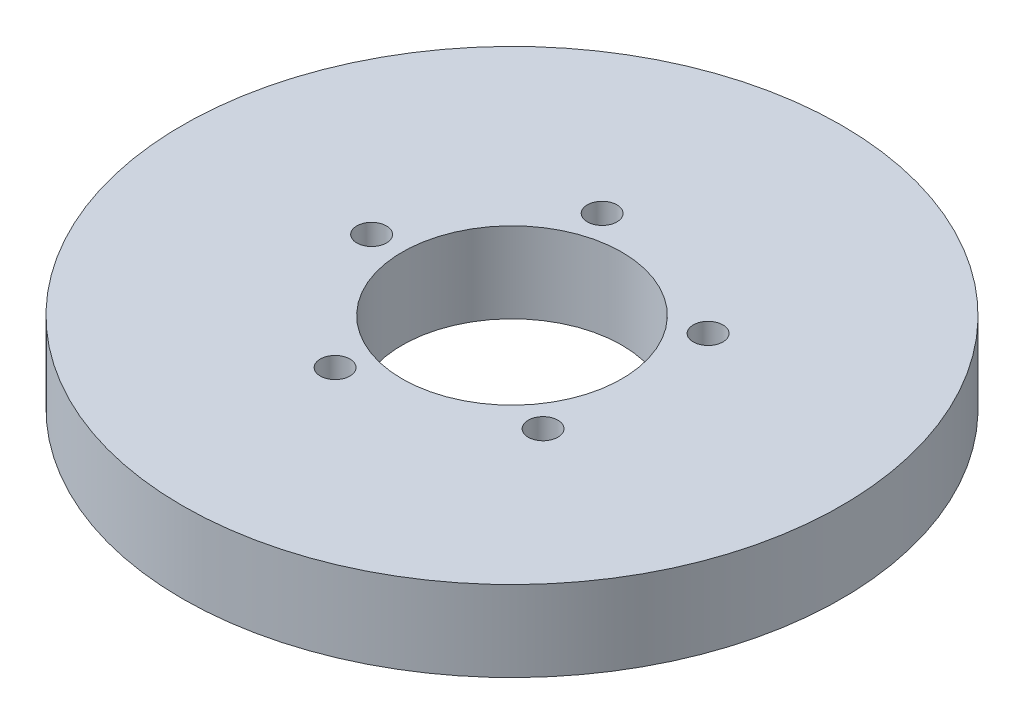
ISO-10303-21;
HEADER;
FILE_DESCRIPTION(('STEP AP214'),'2;1');
FILE_NAME('part.step','',(''),(''),'','','');
FILE_SCHEMA(('AUTOMOTIVE_DESIGN { 1 0 10303 214 1 1 1 1 }'));
ENDSEC;
DATA;
#1=APPLICATION_CONTEXT('core data for automotive mechanical design processes');
#2=APPLICATION_PROTOCOL_DEFINITION('international standard','automotive_design',2000,#1);
#3=PRODUCT_CONTEXT('',#1,'mechanical');
#4=PRODUCT('Part','Part','',(#3));
#5=PRODUCT_RELATED_PRODUCT_CATEGORY('part','',(#4));
#6=PRODUCT_DEFINITION_FORMATION('','',#4);
#7=PRODUCT_DEFINITION_CONTEXT('part definition',#1,'design');
#8=PRODUCT_DEFINITION('design','',#6,#7);
#9=PRODUCT_DEFINITION_SHAPE('','',#8);
#10=(LENGTH_UNIT() NAMED_UNIT(*) SI_UNIT(.MILLI.,.METRE.));
#11=(NAMED_UNIT(*) PLANE_ANGLE_UNIT() SI_UNIT($,.RADIAN.));
#12=(NAMED_UNIT(*) SI_UNIT($,.STERADIAN.) SOLID_ANGLE_UNIT());
#13=UNCERTAINTY_MEASURE_WITH_UNIT(LENGTH_MEASURE(1.E-05),#10,'distance_accuracy_value','');
#14=(GEOMETRIC_REPRESENTATION_CONTEXT(3) GLOBAL_UNCERTAINTY_ASSIGNED_CONTEXT((#13)) GLOBAL_UNIT_ASSIGNED_CONTEXT((#10,
#11,#12)) REPRESENTATION_CONTEXT('',''));
#15=CARTESIAN_POINT('',(0.,0.,0.));
#16=DIRECTION('',(0.,0.,1.));
#17=DIRECTION('',(1.,0.,0.));
#18=AXIS2_PLACEMENT_3D('',#15,#16,#17);
#19=CARTESIAN_POINT('',(0.,11.,0.));
#20=DIRECTION('',(0.,-1.,0.));
#21=DIRECTION('',(0.,0.,-1.));
#22=AXIS2_PLACEMENT_3D('',#19,#20,#21);
#23=CYLINDRICAL_SURFACE('',#22,45.);
#24=CARTESIAN_POINT('',(0.,11.,0.));
#25=DIRECTION('',(0.,1.,0.));
#26=DIRECTION('',(0.,0.,1.));
#27=AXIS2_PLACEMENT_3D('',#24,#25,#26);
#28=CIRCLE('',#27,45.);
#29=CARTESIAN_POINT('',(0.,11.,45.));
#30=VERTEX_POINT('',#29);
#31=EDGE_CURVE('E10',#30,#30,#28,.T.);
#32=ORIENTED_EDGE('',*,*,#31,.F.);
#33=EDGE_LOOP('',(#32));
#34=FACE_BOUND('',#33,.T.);
#35=CARTESIAN_POINT('',(0.,0.,0.));
#36=DIRECTION('',(0.,1.,0.));
#37=DIRECTION('',(0.,0.,1.));
#38=AXIS2_PLACEMENT_3D('',#35,#36,#37);
#39=CIRCLE('',#38,45.);
#40=CARTESIAN_POINT('',(0.,0.,45.));
#41=VERTEX_POINT('',#40);
#42=EDGE_CURVE('E37',#41,#41,#39,.T.);
#43=ORIENTED_EDGE('',*,*,#42,.T.);
#44=EDGE_LOOP('',(#43));
#45=FACE_BOUND('',#44,.T.);
#46=ADVANCED_FACE('F40',(#34,#45),#23,.T.);
#47=CARTESIAN_POINT('',(0.,11.,0.));
#48=DIRECTION('',(0.,1.,0.));
#49=DIRECTION('',(0.,0.,1.));
#50=AXIS2_PLACEMENT_3D('',#47,#48,#49);
#51=PLANE('',#50);
#52=CARTESIAN_POINT('',(-5.9234889176696,11.,18.230624324552));
#53=DIRECTION('',(0.,1.,0.));
#54=DIRECTION('',(0.951056516295155,0.,0.309016994374945));
#55=AXIS2_PLACEMENT_3D('',#52,#53,#54);
#56=CIRCLE('',#55,2.02380194989782);
#57=CARTESIAN_POINT('',(-5.9234889176696,11.,20.2544262744498));
#58=VERTEX_POINT('',#57);
#59=EDGE_CURVE('E78',#58,#58,#56,.T.);
#60=ORIENTED_EDGE('',*,*,#59,.F.);
#61=EDGE_LOOP('',(#60));
#62=FACE_BOUND('',#61,.T.);
#63=CARTESIAN_POINT('',(15.5078953184425,11.,11.2671454687036));
#64=DIRECTION('',(0.,1.,0.));
#65=DIRECTION('',(0.587785252292469,0.,-0.809016994374951));
#66=AXIS2_PLACEMENT_3D('',#63,#64,#65);
#67=CIRCLE('',#66,2.02380194989782);
#68=CARTESIAN_POINT('',(15.5078953184425,11.,13.2909474186014));
#69=VERTEX_POINT('',#68);
#70=EDGE_CURVE('E71',#69,#69,#67,.T.);
#71=ORIENTED_EDGE('',*,*,#70,.F.);
#72=EDGE_LOOP('',(#71));
#73=FACE_BOUND('',#72,.T.);
#74=CARTESIAN_POINT('',(15.5078953184424,11.,-11.2671454687038));
#75=DIRECTION('',(0.,1.,0.));
#76=DIRECTION('',(-0.58778525229248,0.,-0.809016994374942));
#77=AXIS2_PLACEMENT_3D('',#74,#75,#76);
#78=CIRCLE('',#77,2.02380194989782);
#79=CARTESIAN_POINT('',(15.5078953184424,11.,-9.24334351880601));
#80=VERTEX_POINT('',#79);
#81=EDGE_CURVE('E70',#80,#80,#78,.T.);
#82=ORIENTED_EDGE('',*,*,#81,.F.);
#83=EDGE_LOOP('',(#82));
#84=FACE_BOUND('',#83,.T.);
#85=CARTESIAN_POINT('',(-5.92348891766986,11.,-18.2306243245519));
#86=DIRECTION('',(0.,1.,0.));
#87=DIRECTION('',(-0.95105651629515,0.,0.309016994374958));
#88=AXIS2_PLACEMENT_3D('',#85,#86,#87);
#89=CIRCLE('',#88,2.02380194989782);
#90=CARTESIAN_POINT('',(-5.92348891766986,11.,-16.2068223746541));
#91=VERTEX_POINT('',#90);
#92=EDGE_CURVE('E61',#91,#91,#89,.T.);
#93=ORIENTED_EDGE('',*,*,#92,.F.);
#94=EDGE_LOOP('',(#93));
#95=FACE_BOUND('',#94,.T.);
#96=CARTESIAN_POINT('',(-19.1688128015456,11.,0.));
#97=DIRECTION('',(0.,1.,0.));
#98=DIRECTION('',(0.,0.,1.));
#99=AXIS2_PLACEMENT_3D('',#96,#97,#98);
#100=CIRCLE('',#99,2.02380194989782);
#101=CARTESIAN_POINT('',(-19.1688128015456,11.,2.02380194989782));
#102=VERTEX_POINT('',#101);
#103=EDGE_CURVE('E54',#102,#102,#100,.T.);
#104=ORIENTED_EDGE('',*,*,#103,.F.);
#105=EDGE_LOOP('',(#104));
#106=FACE_BOUND('',#105,.T.);
#107=CARTESIAN_POINT('',(0.,11.,0.));
#108=DIRECTION('',(0.,1.,0.));
#109=DIRECTION('',(0.,0.,1.));
#110=AXIS2_PLACEMENT_3D('',#107,#108,#109);
#111=CIRCLE('',#110,15.);
#112=CARTESIAN_POINT('',(0.,11.,15.));
#113=VERTEX_POINT('',#112);
#114=EDGE_CURVE('E50',#113,#113,#111,.T.);
#115=ORIENTED_EDGE('',*,*,#114,.F.);
#116=EDGE_LOOP('',(#115));
#117=FACE_BOUND('',#116,.T.);
#118=ORIENTED_EDGE('',*,*,#31,.T.);
#119=EDGE_LOOP('',(#118));
#120=FACE_BOUND('',#119,.T.);
#121=ADVANCED_FACE('F94',(#62,#73,#84,#95,#106,#117,#120),#51,.T.);
#122=CARTESIAN_POINT('',(0.,0.,0.));
#123=DIRECTION('',(0.,1.,0.));
#124=DIRECTION('',(0.,0.,1.));
#125=AXIS2_PLACEMENT_3D('',#122,#123,#124);
#126=PLANE('',#125);
#127=CARTESIAN_POINT('',(0.,0.,0.));
#128=DIRECTION('',(0.,1.,0.));
#129=DIRECTION('',(0.,0.,1.));
#130=AXIS2_PLACEMENT_3D('',#127,#128,#129);
#131=CIRCLE('',#130,15.);
#132=CARTESIAN_POINT('',(0.,0.,15.));
#133=VERTEX_POINT('',#132);
#134=EDGE_CURVE('E47',#133,#133,#131,.T.);
#135=ORIENTED_EDGE('',*,*,#134,.T.);
#136=EDGE_LOOP('',(#135));
#137=FACE_BOUND('',#136,.T.);
#138=ORIENTED_EDGE('',*,*,#42,.F.);
#139=EDGE_LOOP('',(#138));
#140=FACE_BOUND('',#139,.T.);
#141=ADVANCED_FACE('F100',(#137,#140),#126,.F.);
#142=CARTESIAN_POINT('',(0.,11.,0.));
#143=DIRECTION('',(0.,-1.,0.));
#144=DIRECTION('',(0.,0.,-1.));
#145=AXIS2_PLACEMENT_3D('',#142,#143,#144);
#146=CYLINDRICAL_SURFACE('',#145,15.);
#147=ORIENTED_EDGE('',*,*,#114,.T.);
#148=EDGE_LOOP('',(#147));
#149=FACE_BOUND('',#148,.T.);
#150=ORIENTED_EDGE('',*,*,#134,.F.);
#151=EDGE_LOOP('',(#150));
#152=FACE_BOUND('',#151,.T.);
#153=ADVANCED_FACE('F108',(#149,#152),#146,.F.);
#154=CARTESIAN_POINT('',(-19.1688128015456,2.25779650129062,0.));
#155=DIRECTION('',(0.,1.,0.));
#156=DIRECTION('',(0.,0.,1.));
#157=AXIS2_PLACEMENT_3D('',#154,#155,#156);
#158=CYLINDRICAL_SURFACE('',#157,2.02380194989782);
#159=CARTESIAN_POINT('',(-19.1688128015456,2.25779650129062,0.));
#160=DIRECTION('',(0.,1.,0.));
#161=DIRECTION('',(0.,0.,1.));
#162=AXIS2_PLACEMENT_3D('',#159,#160,#161);
#163=CIRCLE('',#162,2.02380194989782);
#164=CARTESIAN_POINT('',(-19.1688128015456,2.25779650129062,2.02380194989782));
#165=VERTEX_POINT('',#164);
#166=EDGE_CURVE('E55',#165,#165,#163,.T.);
#167=CARTESIAN_POINT('',(-19.1688128015456,2.25779650129062,2.02380194989782));
#168=CARTESIAN_POINT('',(-19.1688128015456,2.34886112106884,2.02380194989782));
#169=CARTESIAN_POINT('',(-19.1688128015456,2.43992574084707,2.02380194989782));
#170=CARTESIAN_POINT('',(-19.1688128015456,2.62205498040351,2.02380194989782));
#171=CARTESIAN_POINT('',(-19.1688128015456,2.71311960018173,2.02380194989782));
#172=CARTESIAN_POINT('',(-19.1688128015456,2.89524883973818,2.02380194989782));
#173=CARTESIAN_POINT('',(-19.1688128015456,2.9863134595164,2.02380194989782));
#174=CARTESIAN_POINT('',(-19.1688128015456,3.16844269907285,2.02380194989782));
#175=CARTESIAN_POINT('',(-19.1688128015456,3.25950731885107,2.02380194989782));
#176=CARTESIAN_POINT('',(-19.1688128015456,3.44163655840752,2.02380194989782));
#177=CARTESIAN_POINT('',(-19.1688128015456,3.53270117818574,2.02380194989782));
#178=CARTESIAN_POINT('',(-19.1688128015456,3.71483041774218,2.02380194989782));
#179=CARTESIAN_POINT('',(-19.1688128015456,3.80589503752041,2.02380194989782));
#180=CARTESIAN_POINT('',(-19.1688128015456,3.98802427707685,2.02380194989782));
#181=CARTESIAN_POINT('',(-19.1688128015456,4.07908889685508,2.02380194989782));
#182=CARTESIAN_POINT('',(-19.1688128015456,4.26121813641152,2.02380194989782));
#183=CARTESIAN_POINT('',(-19.1688128015456,4.35228275618974,2.02380194989782));
#184=CARTESIAN_POINT('',(-19.1688128015456,4.53441199574619,2.02380194989782));
#185=CARTESIAN_POINT('',(-19.1688128015456,4.62547661552441,2.02380194989782));
#186=CARTESIAN_POINT('',(-19.1688128015456,4.80760585508086,2.02380194989782));
#187=CARTESIAN_POINT('',(-19.1688128015456,4.89867047485908,2.02380194989782));
#188=CARTESIAN_POINT('',(-19.1688128015456,5.08079971441552,2.02380194989782));
#189=CARTESIAN_POINT('',(-19.1688128015456,5.17186433419375,2.02380194989782));
#190=CARTESIAN_POINT('',(-19.1688128015456,5.35399357375019,2.02380194989782));
#191=CARTESIAN_POINT('',(-19.1688128015456,5.44505819352842,2.02380194989782));
#192=CARTESIAN_POINT('',(-19.1688128015456,5.62718743308486,2.02380194989782));
#193=CARTESIAN_POINT('',(-19.1688128015456,5.71825205286308,2.02380194989782));
#194=CARTESIAN_POINT('',(-19.1688128015456,5.90038129241953,2.02380194989782));
#195=CARTESIAN_POINT('',(-19.1688128015456,5.99144591219775,2.02380194989782));
#196=CARTESIAN_POINT('',(-19.1688128015456,6.1735751517542,2.02380194989782));
#197=CARTESIAN_POINT('',(-19.1688128015456,6.26463977153242,2.02380194989782));
#198=CARTESIAN_POINT('',(-19.1688128015456,6.44676901108886,2.02380194989782));
#199=CARTESIAN_POINT('',(-19.1688128015456,6.53783363086709,2.02380194989782));
#200=CARTESIAN_POINT('',(-19.1688128015456,6.71996287042353,2.02380194989782));
#201=CARTESIAN_POINT('',(-19.1688128015456,6.81102749020176,2.02380194989782));
#202=CARTESIAN_POINT('',(-19.1688128015456,6.9931567297582,2.02380194989782));
#203=CARTESIAN_POINT('',(-19.1688128015456,7.08422134953642,2.02380194989782));
#204=CARTESIAN_POINT('',(-19.1688128015456,7.26635058909287,2.02380194989782));
#205=CARTESIAN_POINT('',(-19.1688128015456,7.35741520887109,2.02380194989782));
#206=CARTESIAN_POINT('',(-19.1688128015456,7.53954444842754,2.02380194989782));
#207=CARTESIAN_POINT('',(-19.1688128015456,7.63060906820576,2.02380194989782));
#208=CARTESIAN_POINT('',(-19.1688128015456,7.81273830776221,2.02380194989782));
#209=CARTESIAN_POINT('',(-19.1688128015456,7.90380292754043,2.02380194989782));
#210=CARTESIAN_POINT('',(-19.1688128015456,8.08593216709687,2.02380194989782));
#211=CARTESIAN_POINT('',(-19.1688128015456,8.1769967868751,2.02380194989782));
#212=CARTESIAN_POINT('',(-19.1688128015456,8.35912602643154,2.02380194989782));
#213=CARTESIAN_POINT('',(-19.1688128015456,8.45019064620976,2.02380194989782));
#214=CARTESIAN_POINT('',(-19.1688128015456,8.63231988576621,2.02380194989782));
#215=CARTESIAN_POINT('',(-19.1688128015456,8.72338450554443,2.02380194989782));
#216=CARTESIAN_POINT('',(-19.1688128015456,8.90551374510088,2.02380194989782));
#217=CARTESIAN_POINT('',(-19.1688128015456,8.9965783648791,2.02380194989782));
#218=CARTESIAN_POINT('',(-19.1688128015456,9.17870760443555,2.02380194989782));
#219=CARTESIAN_POINT('',(-19.1688128015456,9.26977222421377,2.02380194989782));
#220=CARTESIAN_POINT('',(-19.1688128015456,9.45190146377021,2.02380194989782));
#221=CARTESIAN_POINT('',(-19.1688128015456,9.54296608354844,2.02380194989782));
#222=CARTESIAN_POINT('',(-19.1688128015456,9.72509532310488,2.02380194989782));
#223=CARTESIAN_POINT('',(-19.1688128015456,9.8161599428831,2.02380194989782));
#224=CARTESIAN_POINT('',(-19.1688128015456,9.99828918243955,2.02380194989782));
#225=CARTESIAN_POINT('',(-19.1688128015456,10.0893538022178,2.02380194989782));
#226=CARTESIAN_POINT('',(-19.1688128015456,10.2714830417742,2.02380194989782));
#227=CARTESIAN_POINT('',(-19.1688128015456,10.3625476615524,2.02380194989782));
#228=CARTESIAN_POINT('',(-19.1688128015456,10.5446769011089,2.02380194989782));
#229=CARTESIAN_POINT('',(-19.1688128015456,10.6357415208871,2.02380194989782));
#230=CARTESIAN_POINT('',(-19.1688128015456,10.8178707604436,2.02380194989782));
#231=CARTESIAN_POINT('',(-19.1688128015456,10.9089353802218,2.02380194989782));
#232=CARTESIAN_POINT('',(-19.1688128015456,11.,2.02380194989782));
#233=B_SPLINE_CURVE_WITH_KNOTS('',3,(#167,#168,#169,#170,#171,#172,#173,#174,#175,#176,#177,
#178,#179,#180,#181,#182,#183,#184,#185,#186,#187,#188,#189,#190,#191,#192,#193,#194,#195,#196,
#197,#198,#199,#200,#201,#202,#203,#204,#205,#206,#207,#208,#209,#210,#211,#212,#213,#214,#215,
#216,#217,#218,#219,#220,#221,#222,#223,#224,#225,#226,#227,#228,#229,#230,#231,#232),
.UNSPECIFIED.,.F.,.F.,(4,2,2,2,2,2,2,2,2,2,2,2,2,2,2,2,2,2,2,2,2,2,2,2,2,2,2,2,2,2,2,2,4),(0.,
0.273193859334668,0.546387718669336,0.819581578004004,1.09277543733867,1.36596929667334,
1.63916315600801,1.91235701534268,2.18555087467734,2.45874473401201,2.73193859334668,
3.00513245268135,3.27832631201602,3.55152017135069,3.82471403068535,4.09790789002002,
4.37110174935469,4.64429560868936,4.91748946802403,5.19068332735869,5.46387718669336,
5.73707104602803,6.0102649053627,6.28345876469736,6.55665262403203,6.8298464833667,
7.10304034270137,7.37623420203604,7.64942806137071,7.92262192070537,8.19581578004004,
8.46900963937471,8.74220349870938),.UNSPECIFIED.);
#234=EDGE_CURVE('BSEAM115',#165,#102,#233,.T.);
#235=ORIENTED_EDGE('',*,*,#166,.F.);
#236=ORIENTED_EDGE('',*,*,#103,.T.);
#237=ORIENTED_EDGE('',*,*,#234,.T.);
#238=ORIENTED_EDGE('',*,*,#234,.F.);
#239=EDGE_LOOP('',(#235,#237,#236,#238));
#240=FACE_BOUND('',#239,.T.);
#241=ADVANCED_FACE('F115',(#240),#158,.F.);
#242=CARTESIAN_POINT('',(-19.1688128015456,2.25779650129062,0.));
#243=DIRECTION('',(0.,1.,0.));
#244=DIRECTION('',(0.,0.,1.));
#245=AXIS2_PLACEMENT_3D('',#242,#243,#244);
#246=PLANE('',#245);
#247=ORIENTED_EDGE('',*,*,#166,.T.);
#248=EDGE_LOOP('',(#247));
#249=FACE_BOUND('',#248,.T.);
#250=ADVANCED_FACE('F142',(#249),#246,.T.);
#251=CARTESIAN_POINT('',(-5.92348891766986,2.25779650129062,-18.2306243245519));
#252=DIRECTION('',(0.,1.,0.));
#253=DIRECTION('',(0.,0.,1.));
#254=AXIS2_PLACEMENT_3D('',#251,#252,#253);
#255=CYLINDRICAL_SURFACE('',#254,2.02380194989782);
#256=CARTESIAN_POINT('',(-5.92348891766986,2.25779650129062,-18.2306243245519));
#257=DIRECTION('',(0.,1.,0.));
#258=DIRECTION('',(-0.95105651629515,0.,0.309016994374958));
#259=AXIS2_PLACEMENT_3D('',#256,#257,#258);
#260=CIRCLE('',#259,2.02380194989782);
#261=CARTESIAN_POINT('',(-5.92348891766986,2.25779650129062,-16.2068223746541));
#262=VERTEX_POINT('',#261);
#263=EDGE_CURVE('E63',#262,#262,#260,.T.);
#264=CARTESIAN_POINT('',(-5.92348891766986,2.25779650129062,-16.2068223746541));
#265=CARTESIAN_POINT('',(-5.92348891766986,2.34886112106884,-16.2068223746541));
#266=CARTESIAN_POINT('',(-5.92348891766986,2.43992574084707,-16.2068223746541));
#267=CARTESIAN_POINT('',(-5.92348891766986,2.62205498040351,-16.2068223746541));
#268=CARTESIAN_POINT('',(-5.92348891766986,2.71311960018173,-16.2068223746541));
#269=CARTESIAN_POINT('',(-5.92348891766986,2.89524883973818,-16.2068223746541));
#270=CARTESIAN_POINT('',(-5.92348891766986,2.9863134595164,-16.2068223746541));
#271=CARTESIAN_POINT('',(-5.92348891766986,3.16844269907285,-16.2068223746541));
#272=CARTESIAN_POINT('',(-5.92348891766986,3.25950731885107,-16.2068223746541));
#273=CARTESIAN_POINT('',(-5.92348891766986,3.44163655840752,-16.2068223746541));
#274=CARTESIAN_POINT('',(-5.92348891766986,3.53270117818574,-16.2068223746541));
#275=CARTESIAN_POINT('',(-5.92348891766986,3.71483041774218,-16.2068223746541));
#276=CARTESIAN_POINT('',(-5.92348891766986,3.80589503752041,-16.2068223746541));
#277=CARTESIAN_POINT('',(-5.92348891766986,3.98802427707685,-16.2068223746541));
#278=CARTESIAN_POINT('',(-5.92348891766986,4.07908889685508,-16.2068223746541));
#279=CARTESIAN_POINT('',(-5.92348891766986,4.26121813641152,-16.2068223746541));
#280=CARTESIAN_POINT('',(-5.92348891766986,4.35228275618974,-16.2068223746541));
#281=CARTESIAN_POINT('',(-5.92348891766986,4.53441199574619,-16.2068223746541));
#282=CARTESIAN_POINT('',(-5.92348891766986,4.62547661552441,-16.2068223746541));
#283=CARTESIAN_POINT('',(-5.92348891766986,4.80760585508086,-16.2068223746541));
#284=CARTESIAN_POINT('',(-5.92348891766986,4.89867047485908,-16.2068223746541));
#285=CARTESIAN_POINT('',(-5.92348891766986,5.08079971441552,-16.2068223746541));
#286=CARTESIAN_POINT('',(-5.92348891766986,5.17186433419375,-16.2068223746541));
#287=CARTESIAN_POINT('',(-5.92348891766986,5.35399357375019,-16.2068223746541));
#288=CARTESIAN_POINT('',(-5.92348891766986,5.44505819352842,-16.2068223746541));
#289=CARTESIAN_POINT('',(-5.92348891766986,5.62718743308486,-16.2068223746541));
#290=CARTESIAN_POINT('',(-5.92348891766986,5.71825205286308,-16.2068223746541));
#291=CARTESIAN_POINT('',(-5.92348891766986,5.90038129241953,-16.2068223746541));
#292=CARTESIAN_POINT('',(-5.92348891766986,5.99144591219775,-16.2068223746541));
#293=CARTESIAN_POINT('',(-5.92348891766986,6.1735751517542,-16.2068223746541));
#294=CARTESIAN_POINT('',(-5.92348891766986,6.26463977153242,-16.2068223746541));
#295=CARTESIAN_POINT('',(-5.92348891766986,6.44676901108886,-16.2068223746541));
#296=CARTESIAN_POINT('',(-5.92348891766986,6.53783363086709,-16.2068223746541));
#297=CARTESIAN_POINT('',(-5.92348891766986,6.71996287042353,-16.2068223746541));
#298=CARTESIAN_POINT('',(-5.92348891766986,6.81102749020176,-16.2068223746541));
#299=CARTESIAN_POINT('',(-5.92348891766986,6.9931567297582,-16.2068223746541));
#300=CARTESIAN_POINT('',(-5.92348891766986,7.08422134953642,-16.2068223746541));
#301=CARTESIAN_POINT('',(-5.92348891766986,7.26635058909287,-16.2068223746541));
#302=CARTESIAN_POINT('',(-5.92348891766986,7.35741520887109,-16.2068223746541));
#303=CARTESIAN_POINT('',(-5.92348891766986,7.53954444842754,-16.2068223746541));
#304=CARTESIAN_POINT('',(-5.92348891766986,7.63060906820576,-16.2068223746541));
#305=CARTESIAN_POINT('',(-5.92348891766986,7.81273830776221,-16.2068223746541));
#306=CARTESIAN_POINT('',(-5.92348891766986,7.90380292754043,-16.2068223746541));
#307=CARTESIAN_POINT('',(-5.92348891766986,8.08593216709687,-16.2068223746541));
#308=CARTESIAN_POINT('',(-5.92348891766986,8.1769967868751,-16.2068223746541));
#309=CARTESIAN_POINT('',(-5.92348891766986,8.35912602643154,-16.2068223746541));
#310=CARTESIAN_POINT('',(-5.92348891766986,8.45019064620976,-16.2068223746541));
#311=CARTESIAN_POINT('',(-5.92348891766986,8.63231988576621,-16.2068223746541));
#312=CARTESIAN_POINT('',(-5.92348891766986,8.72338450554443,-16.2068223746541));
#313=CARTESIAN_POINT('',(-5.92348891766986,8.90551374510088,-16.2068223746541));
#314=CARTESIAN_POINT('',(-5.92348891766986,8.9965783648791,-16.2068223746541));
#315=CARTESIAN_POINT('',(-5.92348891766986,9.17870760443555,-16.2068223746541));
#316=CARTESIAN_POINT('',(-5.92348891766986,9.26977222421377,-16.2068223746541));
#317=CARTESIAN_POINT('',(-5.92348891766986,9.45190146377021,-16.2068223746541));
#318=CARTESIAN_POINT('',(-5.92348891766986,9.54296608354844,-16.2068223746541));
#319=CARTESIAN_POINT('',(-5.92348891766986,9.72509532310488,-16.2068223746541));
#320=CARTESIAN_POINT('',(-5.92348891766986,9.8161599428831,-16.2068223746541));
#321=CARTESIAN_POINT('',(-5.92348891766986,9.99828918243955,-16.2068223746541));
#322=CARTESIAN_POINT('',(-5.92348891766986,10.0893538022178,-16.2068223746541));
#323=CARTESIAN_POINT('',(-5.92348891766986,10.2714830417742,-16.2068223746541));
#324=CARTESIAN_POINT('',(-5.92348891766986,10.3625476615524,-16.2068223746541));
#325=CARTESIAN_POINT('',(-5.92348891766986,10.5446769011089,-16.2068223746541));
#326=CARTESIAN_POINT('',(-5.92348891766986,10.6357415208871,-16.2068223746541));
#327=CARTESIAN_POINT('',(-5.92348891766986,10.8178707604436,-16.2068223746541));
#328=CARTESIAN_POINT('',(-5.92348891766986,10.9089353802218,-16.2068223746541));
#329=CARTESIAN_POINT('',(-5.92348891766986,11.,-16.2068223746541));
#330=B_SPLINE_CURVE_WITH_KNOTS('',3,(#264,#265,#266,#267,#268,#269,#270,#271,#272,#273,#274,
#275,#276,#277,#278,#279,#280,#281,#282,#283,#284,#285,#286,#287,#288,#289,#290,#291,#292,#293,
#294,#295,#296,#297,#298,#299,#300,#301,#302,#303,#304,#305,#306,#307,#308,#309,#310,#311,#312,
#313,#314,#315,#316,#317,#318,#319,#320,#321,#322,#323,#324,#325,#326,#327,#328,#329),
.UNSPECIFIED.,.F.,.F.,(4,2,2,2,2,2,2,2,2,2,2,2,2,2,2,2,2,2,2,2,2,2,2,2,2,2,2,2,2,2,2,2,4),(0.,
0.273193859334668,0.546387718669336,0.819581578004004,1.09277543733867,1.36596929667334,
1.63916315600801,1.91235701534268,2.18555087467734,2.45874473401201,2.73193859334668,
3.00513245268135,3.27832631201602,3.55152017135069,3.82471403068535,4.09790789002002,
4.37110174935469,4.64429560868936,4.91748946802403,5.19068332735869,5.46387718669336,
5.73707104602803,6.0102649053627,6.28345876469736,6.55665262403203,6.8298464833667,
7.10304034270137,7.37623420203604,7.64942806137071,7.92262192070537,8.19581578004004,
8.46900963937471,8.74220349870938),.UNSPECIFIED.);
#331=EDGE_CURVE('BSEAM147',#262,#91,#330,.T.);
#332=ORIENTED_EDGE('',*,*,#263,.F.);
#333=ORIENTED_EDGE('',*,*,#92,.T.);
#334=ORIENTED_EDGE('',*,*,#331,.T.);
#335=ORIENTED_EDGE('',*,*,#331,.F.);
#336=EDGE_LOOP('',(#332,#334,#333,#335));
#337=FACE_BOUND('',#336,.T.);
#338=ADVANCED_FACE('F147',(#337),#255,.F.);
#339=CARTESIAN_POINT('',(-5.92348891766986,2.25779650129062,-18.2306243245519));
#340=DIRECTION('',(0.,1.,0.));
#341=DIRECTION('',(-0.95105651629515,0.,0.309016994374958));
#342=AXIS2_PLACEMENT_3D('',#339,#340,#341);
#343=PLANE('',#342);
#344=ORIENTED_EDGE('',*,*,#263,.T.);
#345=EDGE_LOOP('',(#344));
#346=FACE_BOUND('',#345,.T.);
#347=ADVANCED_FACE('F163',(#346),#343,.T.);
#348=CARTESIAN_POINT('',(15.5078953184424,2.25779650129062,-11.2671454687038));
#349=DIRECTION('',(0.,1.,0.));
#350=DIRECTION('',(0.,0.,1.));
#351=AXIS2_PLACEMENT_3D('',#348,#349,#350);
#352=CYLINDRICAL_SURFACE('',#351,2.02380194989782);
#353=CARTESIAN_POINT('',(15.5078953184424,2.25779650129062,-11.2671454687038));
#354=DIRECTION('',(0.,1.,0.));
#355=DIRECTION('',(-0.58778525229248,0.,-0.809016994374942));
#356=AXIS2_PLACEMENT_3D('',#353,#354,#355);
#357=CIRCLE('',#356,2.02380194989782);
#358=CARTESIAN_POINT('',(15.5078953184424,2.25779650129062,-9.24334351880601));
#359=VERTEX_POINT('',#358);
#360=EDGE_CURVE('E69',#359,#359,#357,.T.);
#361=CARTESIAN_POINT('',(15.5078953184424,2.25779650129062,-9.24334351880601));
#362=CARTESIAN_POINT('',(15.5078953184424,2.34886112106884,-9.24334351880601));
#363=CARTESIAN_POINT('',(15.5078953184424,2.43992574084707,-9.24334351880601));
#364=CARTESIAN_POINT('',(15.5078953184424,2.62205498040351,-9.24334351880601));
#365=CARTESIAN_POINT('',(15.5078953184424,2.71311960018173,-9.24334351880601));
#366=CARTESIAN_POINT('',(15.5078953184424,2.89524883973818,-9.24334351880601));
#367=CARTESIAN_POINT('',(15.5078953184424,2.9863134595164,-9.24334351880601));
#368=CARTESIAN_POINT('',(15.5078953184424,3.16844269907285,-9.24334351880601));
#369=CARTESIAN_POINT('',(15.5078953184424,3.25950731885107,-9.24334351880601));
#370=CARTESIAN_POINT('',(15.5078953184424,3.44163655840752,-9.24334351880601));
#371=CARTESIAN_POINT('',(15.5078953184424,3.53270117818574,-9.24334351880601));
#372=CARTESIAN_POINT('',(15.5078953184424,3.71483041774218,-9.24334351880601));
#373=CARTESIAN_POINT('',(15.5078953184424,3.80589503752041,-9.24334351880601));
#374=CARTESIAN_POINT('',(15.5078953184424,3.98802427707685,-9.24334351880601));
#375=CARTESIAN_POINT('',(15.5078953184424,4.07908889685508,-9.24334351880601));
#376=CARTESIAN_POINT('',(15.5078953184424,4.26121813641152,-9.24334351880601));
#377=CARTESIAN_POINT('',(15.5078953184424,4.35228275618974,-9.24334351880601));
#378=CARTESIAN_POINT('',(15.5078953184424,4.53441199574619,-9.24334351880601));
#379=CARTESIAN_POINT('',(15.5078953184424,4.62547661552441,-9.24334351880601));
#380=CARTESIAN_POINT('',(15.5078953184424,4.80760585508086,-9.24334351880601));
#381=CARTESIAN_POINT('',(15.5078953184424,4.89867047485908,-9.24334351880601));
#382=CARTESIAN_POINT('',(15.5078953184424,5.08079971441552,-9.24334351880601));
#383=CARTESIAN_POINT('',(15.5078953184424,5.17186433419375,-9.24334351880601));
#384=CARTESIAN_POINT('',(15.5078953184424,5.35399357375019,-9.24334351880601));
#385=CARTESIAN_POINT('',(15.5078953184424,5.44505819352842,-9.24334351880601));
#386=CARTESIAN_POINT('',(15.5078953184424,5.62718743308486,-9.24334351880601));
#387=CARTESIAN_POINT('',(15.5078953184424,5.71825205286308,-9.24334351880601));
#388=CARTESIAN_POINT('',(15.5078953184424,5.90038129241953,-9.24334351880601));
#389=CARTESIAN_POINT('',(15.5078953184424,5.99144591219775,-9.24334351880601));
#390=CARTESIAN_POINT('',(15.5078953184424,6.1735751517542,-9.24334351880601));
#391=CARTESIAN_POINT('',(15.5078953184424,6.26463977153242,-9.24334351880601));
#392=CARTESIAN_POINT('',(15.5078953184424,6.44676901108886,-9.24334351880601));
#393=CARTESIAN_POINT('',(15.5078953184424,6.53783363086709,-9.24334351880601));
#394=CARTESIAN_POINT('',(15.5078953184424,6.71996287042353,-9.24334351880601));
#395=CARTESIAN_POINT('',(15.5078953184424,6.81102749020176,-9.24334351880601));
#396=CARTESIAN_POINT('',(15.5078953184424,6.9931567297582,-9.24334351880601));
#397=CARTESIAN_POINT('',(15.5078953184424,7.08422134953642,-9.24334351880601));
#398=CARTESIAN_POINT('',(15.5078953184424,7.26635058909287,-9.24334351880601));
#399=CARTESIAN_POINT('',(15.5078953184424,7.35741520887109,-9.24334351880601));
#400=CARTESIAN_POINT('',(15.5078953184424,7.53954444842754,-9.24334351880601));
#401=CARTESIAN_POINT('',(15.5078953184424,7.63060906820576,-9.24334351880601));
#402=CARTESIAN_POINT('',(15.5078953184424,7.81273830776221,-9.24334351880601));
#403=CARTESIAN_POINT('',(15.5078953184424,7.90380292754043,-9.24334351880601));
#404=CARTESIAN_POINT('',(15.5078953184424,8.08593216709687,-9.24334351880601));
#405=CARTESIAN_POINT('',(15.5078953184424,8.1769967868751,-9.24334351880601));
#406=CARTESIAN_POINT('',(15.5078953184424,8.35912602643154,-9.24334351880601));
#407=CARTESIAN_POINT('',(15.5078953184424,8.45019064620976,-9.24334351880601));
#408=CARTESIAN_POINT('',(15.5078953184424,8.63231988576621,-9.24334351880601));
#409=CARTESIAN_POINT('',(15.5078953184424,8.72338450554443,-9.24334351880601));
#410=CARTESIAN_POINT('',(15.5078953184424,8.90551374510088,-9.24334351880601));
#411=CARTESIAN_POINT('',(15.5078953184424,8.9965783648791,-9.24334351880601));
#412=CARTESIAN_POINT('',(15.5078953184424,9.17870760443555,-9.24334351880601));
#413=CARTESIAN_POINT('',(15.5078953184424,9.26977222421377,-9.24334351880601));
#414=CARTESIAN_POINT('',(15.5078953184424,9.45190146377021,-9.24334351880601));
#415=CARTESIAN_POINT('',(15.5078953184424,9.54296608354844,-9.24334351880601));
#416=CARTESIAN_POINT('',(15.5078953184424,9.72509532310488,-9.24334351880601));
#417=CARTESIAN_POINT('',(15.5078953184424,9.8161599428831,-9.24334351880601));
#418=CARTESIAN_POINT('',(15.5078953184424,9.99828918243955,-9.24334351880601));
#419=CARTESIAN_POINT('',(15.5078953184424,10.0893538022178,-9.24334351880601));
#420=CARTESIAN_POINT('',(15.5078953184424,10.2714830417742,-9.24334351880601));
#421=CARTESIAN_POINT('',(15.5078953184424,10.3625476615524,-9.24334351880601));
#422=CARTESIAN_POINT('',(15.5078953184424,10.5446769011089,-9.24334351880601));
#423=CARTESIAN_POINT('',(15.5078953184424,10.6357415208871,-9.24334351880601));
#424=CARTESIAN_POINT('',(15.5078953184424,10.8178707604436,-9.24334351880601));
#425=CARTESIAN_POINT('',(15.5078953184424,10.9089353802218,-9.24334351880601));
#426=CARTESIAN_POINT('',(15.5078953184424,11.,-9.24334351880601));
#427=B_SPLINE_CURVE_WITH_KNOTS('',3,(#361,#362,#363,#364,#365,#366,#367,#368,#369,#370,#371,
#372,#373,#374,#375,#376,#377,#378,#379,#380,#381,#382,#383,#384,#385,#386,#387,#388,#389,#390,
#391,#392,#393,#394,#395,#396,#397,#398,#399,#400,#401,#402,#403,#404,#405,#406,#407,#408,#409,
#410,#411,#412,#413,#414,#415,#416,#417,#418,#419,#420,#421,#422,#423,#424,#425,#426),
.UNSPECIFIED.,.F.,.F.,(4,2,2,2,2,2,2,2,2,2,2,2,2,2,2,2,2,2,2,2,2,2,2,2,2,2,2,2,2,2,2,2,4),(0.,
0.273193859334668,0.546387718669336,0.819581578004004,1.09277543733867,1.36596929667334,
1.63916315600801,1.91235701534268,2.18555087467734,2.45874473401201,2.73193859334668,
3.00513245268135,3.27832631201602,3.55152017135069,3.82471403068535,4.09790789002002,
4.37110174935469,4.64429560868936,4.91748946802403,5.19068332735869,5.46387718669336,
5.73707104602803,6.0102649053627,6.28345876469736,6.55665262403203,6.8298464833667,
7.10304034270137,7.37623420203604,7.64942806137071,7.92262192070537,8.19581578004004,
8.46900963937471,8.74220349870938),.UNSPECIFIED.);
#428=EDGE_CURVE('BSEAM172',#359,#80,#427,.T.);
#429=ORIENTED_EDGE('',*,*,#360,.F.);
#430=ORIENTED_EDGE('',*,*,#81,.T.);
#431=ORIENTED_EDGE('',*,*,#428,.T.);
#432=ORIENTED_EDGE('',*,*,#428,.F.);
#433=EDGE_LOOP('',(#429,#431,#430,#432));
#434=FACE_BOUND('',#433,.T.);
#435=ADVANCED_FACE('F172',(#434),#352,.F.);
#436=CARTESIAN_POINT('',(15.5078953184424,2.25779650129062,-11.2671454687038));
#437=DIRECTION('',(0.,1.,0.));
#438=DIRECTION('',(-0.58778525229248,0.,-0.809016994374942));
#439=AXIS2_PLACEMENT_3D('',#436,#437,#438);
#440=PLANE('',#439);
#441=ORIENTED_EDGE('',*,*,#360,.T.);
#442=EDGE_LOOP('',(#441));
#443=FACE_BOUND('',#442,.T.);
#444=ADVANCED_FACE('F185',(#443),#440,.T.);
#445=CARTESIAN_POINT('',(15.5078953184425,2.25779650129062,11.2671454687036));
#446=DIRECTION('',(0.,1.,0.));
#447=DIRECTION('',(0.,0.,1.));
#448=AXIS2_PLACEMENT_3D('',#445,#446,#447);
#449=CYLINDRICAL_SURFACE('',#448,2.02380194989782);
#450=CARTESIAN_POINT('',(15.5078953184425,2.25779650129062,11.2671454687036));
#451=DIRECTION('',(0.,1.,0.));
#452=DIRECTION('',(0.587785252292469,0.,-0.809016994374951));
#453=AXIS2_PLACEMENT_3D('',#450,#451,#452);
#454=CIRCLE('',#453,2.02380194989782);
#455=CARTESIAN_POINT('',(15.5078953184425,2.25779650129062,13.2909474186014));
#456=VERTEX_POINT('',#455);
#457=EDGE_CURVE('E76',#456,#456,#454,.T.);
#458=CARTESIAN_POINT('',(15.5078953184425,2.25779650129062,13.2909474186014));
#459=CARTESIAN_POINT('',(15.5078953184425,2.34886112106884,13.2909474186014));
#460=CARTESIAN_POINT('',(15.5078953184425,2.43992574084707,13.2909474186014));
#461=CARTESIAN_POINT('',(15.5078953184425,2.62205498040351,13.2909474186014));
#462=CARTESIAN_POINT('',(15.5078953184425,2.71311960018173,13.2909474186014));
#463=CARTESIAN_POINT('',(15.5078953184425,2.89524883973818,13.2909474186014));
#464=CARTESIAN_POINT('',(15.5078953184425,2.9863134595164,13.2909474186014));
#465=CARTESIAN_POINT('',(15.5078953184425,3.16844269907285,13.2909474186014));
#466=CARTESIAN_POINT('',(15.5078953184425,3.25950731885107,13.2909474186014));
#467=CARTESIAN_POINT('',(15.5078953184425,3.44163655840752,13.2909474186014));
#468=CARTESIAN_POINT('',(15.5078953184425,3.53270117818574,13.2909474186014));
#469=CARTESIAN_POINT('',(15.5078953184425,3.71483041774218,13.2909474186014));
#470=CARTESIAN_POINT('',(15.5078953184425,3.80589503752041,13.2909474186014));
#471=CARTESIAN_POINT('',(15.5078953184425,3.98802427707685,13.2909474186014));
#472=CARTESIAN_POINT('',(15.5078953184425,4.07908889685508,13.2909474186014));
#473=CARTESIAN_POINT('',(15.5078953184425,4.26121813641152,13.2909474186014));
#474=CARTESIAN_POINT('',(15.5078953184425,4.35228275618974,13.2909474186014));
#475=CARTESIAN_POINT('',(15.5078953184425,4.53441199574619,13.2909474186014));
#476=CARTESIAN_POINT('',(15.5078953184425,4.62547661552441,13.2909474186014));
#477=CARTESIAN_POINT('',(15.5078953184425,4.80760585508086,13.2909474186014));
#478=CARTESIAN_POINT('',(15.5078953184425,4.89867047485908,13.2909474186014));
#479=CARTESIAN_POINT('',(15.5078953184425,5.08079971441552,13.2909474186014));
#480=CARTESIAN_POINT('',(15.5078953184425,5.17186433419375,13.2909474186014));
#481=CARTESIAN_POINT('',(15.5078953184425,5.35399357375019,13.2909474186014));
#482=CARTESIAN_POINT('',(15.5078953184425,5.44505819352842,13.2909474186014));
#483=CARTESIAN_POINT('',(15.5078953184425,5.62718743308486,13.2909474186014));
#484=CARTESIAN_POINT('',(15.5078953184425,5.71825205286308,13.2909474186014));
#485=CARTESIAN_POINT('',(15.5078953184425,5.90038129241953,13.2909474186014));
#486=CARTESIAN_POINT('',(15.5078953184425,5.99144591219775,13.2909474186014));
#487=CARTESIAN_POINT('',(15.5078953184425,6.1735751517542,13.2909474186014));
#488=CARTESIAN_POINT('',(15.5078953184425,6.26463977153242,13.2909474186014));
#489=CARTESIAN_POINT('',(15.5078953184425,6.44676901108886,13.2909474186014));
#490=CARTESIAN_POINT('',(15.5078953184425,6.53783363086709,13.2909474186014));
#491=CARTESIAN_POINT('',(15.5078953184425,6.71996287042353,13.2909474186014));
#492=CARTESIAN_POINT('',(15.5078953184425,6.81102749020176,13.2909474186014));
#493=CARTESIAN_POINT('',(15.5078953184425,6.9931567297582,13.2909474186014));
#494=CARTESIAN_POINT('',(15.5078953184425,7.08422134953642,13.2909474186014));
#495=CARTESIAN_POINT('',(15.5078953184425,7.26635058909287,13.2909474186014));
#496=CARTESIAN_POINT('',(15.5078953184425,7.35741520887109,13.2909474186014));
#497=CARTESIAN_POINT('',(15.5078953184425,7.53954444842754,13.2909474186014));
#498=CARTESIAN_POINT('',(15.5078953184425,7.63060906820576,13.2909474186014));
#499=CARTESIAN_POINT('',(15.5078953184425,7.81273830776221,13.2909474186014));
#500=CARTESIAN_POINT('',(15.5078953184425,7.90380292754043,13.2909474186014));
#501=CARTESIAN_POINT('',(15.5078953184425,8.08593216709687,13.2909474186014));
#502=CARTESIAN_POINT('',(15.5078953184425,8.1769967868751,13.2909474186014));
#503=CARTESIAN_POINT('',(15.5078953184425,8.35912602643154,13.2909474186014));
#504=CARTESIAN_POINT('',(15.5078953184425,8.45019064620976,13.2909474186014));
#505=CARTESIAN_POINT('',(15.5078953184425,8.63231988576621,13.2909474186014));
#506=CARTESIAN_POINT('',(15.5078953184425,8.72338450554443,13.2909474186014));
#507=CARTESIAN_POINT('',(15.5078953184425,8.90551374510088,13.2909474186014));
#508=CARTESIAN_POINT('',(15.5078953184425,8.9965783648791,13.2909474186014));
#509=CARTESIAN_POINT('',(15.5078953184425,9.17870760443555,13.2909474186014));
#510=CARTESIAN_POINT('',(15.5078953184425,9.26977222421377,13.2909474186014));
#511=CARTESIAN_POINT('',(15.5078953184425,9.45190146377021,13.2909474186014));
#512=CARTESIAN_POINT('',(15.5078953184425,9.54296608354844,13.2909474186014));
#513=CARTESIAN_POINT('',(15.5078953184425,9.72509532310488,13.2909474186014));
#514=CARTESIAN_POINT('',(15.5078953184425,9.8161599428831,13.2909474186014));
#515=CARTESIAN_POINT('',(15.5078953184425,9.99828918243955,13.2909474186014));
#516=CARTESIAN_POINT('',(15.5078953184425,10.0893538022178,13.2909474186014));
#517=CARTESIAN_POINT('',(15.5078953184425,10.2714830417742,13.2909474186014));
#518=CARTESIAN_POINT('',(15.5078953184425,10.3625476615524,13.2909474186014));
#519=CARTESIAN_POINT('',(15.5078953184425,10.5446769011089,13.2909474186014));
#520=CARTESIAN_POINT('',(15.5078953184425,10.6357415208871,13.2909474186014));
#521=CARTESIAN_POINT('',(15.5078953184425,10.8178707604436,13.2909474186014));
#522=CARTESIAN_POINT('',(15.5078953184425,10.9089353802218,13.2909474186014));
#523=CARTESIAN_POINT('',(15.5078953184425,11.,13.2909474186014));
#524=B_SPLINE_CURVE_WITH_KNOTS('',3,(#458,#459,#460,#461,#462,#463,#464,#465,#466,#467,#468,
#469,#470,#471,#472,#473,#474,#475,#476,#477,#478,#479,#480,#481,#482,#483,#484,#485,#486,#487,
#488,#489,#490,#491,#492,#493,#494,#495,#496,#497,#498,#499,#500,#501,#502,#503,#504,#505,#506,
#507,#508,#509,#510,#511,#512,#513,#514,#515,#516,#517,#518,#519,#520,#521,#522,#523),
.UNSPECIFIED.,.F.,.F.,(4,2,2,2,2,2,2,2,2,2,2,2,2,2,2,2,2,2,2,2,2,2,2,2,2,2,2,2,2,2,2,2,4),(0.,
0.273193859334668,0.546387718669336,0.819581578004004,1.09277543733867,1.36596929667334,
1.63916315600801,1.91235701534268,2.18555087467734,2.45874473401201,2.73193859334668,
3.00513245268135,3.27832631201602,3.55152017135069,3.82471403068535,4.09790789002002,
4.37110174935469,4.64429560868936,4.91748946802403,5.19068332735869,5.46387718669336,
5.73707104602803,6.0102649053627,6.28345876469736,6.55665262403203,6.8298464833667,
7.10304034270137,7.37623420203604,7.64942806137071,7.92262192070537,8.19581578004004,
8.46900963937471,8.74220349870938),.UNSPECIFIED.);
#525=EDGE_CURVE('BSEAM191',#456,#69,#524,.T.);
#526=ORIENTED_EDGE('',*,*,#457,.F.);
#527=ORIENTED_EDGE('',*,*,#70,.T.);
#528=ORIENTED_EDGE('',*,*,#525,.T.);
#529=ORIENTED_EDGE('',*,*,#525,.F.);
#530=EDGE_LOOP('',(#526,#528,#527,#529));
#531=FACE_BOUND('',#530,.T.);
#532=ADVANCED_FACE('F191',(#531),#449,.F.);
#533=CARTESIAN_POINT('',(15.5078953184425,2.25779650129062,11.2671454687036));
#534=DIRECTION('',(0.,1.,0.));
#535=DIRECTION('',(0.587785252292469,0.,-0.809016994374951));
#536=AXIS2_PLACEMENT_3D('',#533,#534,#535);
#537=PLANE('',#536);
#538=ORIENTED_EDGE('',*,*,#457,.T.);
#539=EDGE_LOOP('',(#538));
#540=FACE_BOUND('',#539,.T.);
#541=ADVANCED_FACE('F89',(#540),#537,.T.);
#542=CARTESIAN_POINT('',(-5.9234889176696,2.25779650129062,18.230624324552));
#543=DIRECTION('',(0.,1.,0.));
#544=DIRECTION('',(0.,0.,1.));
#545=AXIS2_PLACEMENT_3D('',#542,#543,#544);
#546=CYLINDRICAL_SURFACE('',#545,2.02380194989782);
#547=CARTESIAN_POINT('',(-5.9234889176696,2.25779650129062,18.230624324552));
#548=DIRECTION('',(0.,1.,0.));
#549=DIRECTION('',(0.951056516295155,0.,0.309016994374945));
#550=AXIS2_PLACEMENT_3D('',#547,#548,#549);
#551=CIRCLE('',#550,2.02380194989782);
#552=CARTESIAN_POINT('',(-5.9234889176696,2.25779650129062,20.2544262744498));
#553=VERTEX_POINT('',#552);
#554=EDGE_CURVE('E59',#553,#553,#551,.T.);
#555=CARTESIAN_POINT('',(-5.9234889176696,2.25779650129062,20.2544262744498));
#556=CARTESIAN_POINT('',(-5.9234889176696,2.34886112106884,20.2544262744498));
#557=CARTESIAN_POINT('',(-5.9234889176696,2.43992574084707,20.2544262744498));
#558=CARTESIAN_POINT('',(-5.9234889176696,2.62205498040351,20.2544262744498));
#559=CARTESIAN_POINT('',(-5.9234889176696,2.71311960018173,20.2544262744498));
#560=CARTESIAN_POINT('',(-5.9234889176696,2.89524883973818,20.2544262744498));
#561=CARTESIAN_POINT('',(-5.9234889176696,2.9863134595164,20.2544262744498));
#562=CARTESIAN_POINT('',(-5.9234889176696,3.16844269907285,20.2544262744498));
#563=CARTESIAN_POINT('',(-5.9234889176696,3.25950731885107,20.2544262744498));
#564=CARTESIAN_POINT('',(-5.9234889176696,3.44163655840752,20.2544262744498));
#565=CARTESIAN_POINT('',(-5.9234889176696,3.53270117818574,20.2544262744498));
#566=CARTESIAN_POINT('',(-5.9234889176696,3.71483041774218,20.2544262744498));
#567=CARTESIAN_POINT('',(-5.9234889176696,3.80589503752041,20.2544262744498));
#568=CARTESIAN_POINT('',(-5.9234889176696,3.98802427707685,20.2544262744498));
#569=CARTESIAN_POINT('',(-5.9234889176696,4.07908889685508,20.2544262744498));
#570=CARTESIAN_POINT('',(-5.9234889176696,4.26121813641152,20.2544262744498));
#571=CARTESIAN_POINT('',(-5.9234889176696,4.35228275618974,20.2544262744498));
#572=CARTESIAN_POINT('',(-5.9234889176696,4.53441199574619,20.2544262744498));
#573=CARTESIAN_POINT('',(-5.9234889176696,4.62547661552441,20.2544262744498));
#574=CARTESIAN_POINT('',(-5.9234889176696,4.80760585508086,20.2544262744498));
#575=CARTESIAN_POINT('',(-5.9234889176696,4.89867047485908,20.2544262744498));
#576=CARTESIAN_POINT('',(-5.9234889176696,5.08079971441552,20.2544262744498));
#577=CARTESIAN_POINT('',(-5.9234889176696,5.17186433419375,20.2544262744498));
#578=CARTESIAN_POINT('',(-5.9234889176696,5.35399357375019,20.2544262744498));
#579=CARTESIAN_POINT('',(-5.9234889176696,5.44505819352842,20.2544262744498));
#580=CARTESIAN_POINT('',(-5.9234889176696,5.62718743308486,20.2544262744498));
#581=CARTESIAN_POINT('',(-5.9234889176696,5.71825205286308,20.2544262744498));
#582=CARTESIAN_POINT('',(-5.9234889176696,5.90038129241953,20.2544262744498));
#583=CARTESIAN_POINT('',(-5.9234889176696,5.99144591219775,20.2544262744498));
#584=CARTESIAN_POINT('',(-5.9234889176696,6.1735751517542,20.2544262744498));
#585=CARTESIAN_POINT('',(-5.9234889176696,6.26463977153242,20.2544262744498));
#586=CARTESIAN_POINT('',(-5.9234889176696,6.44676901108886,20.2544262744498));
#587=CARTESIAN_POINT('',(-5.9234889176696,6.53783363086709,20.2544262744498));
#588=CARTESIAN_POINT('',(-5.9234889176696,6.71996287042353,20.2544262744498));
#589=CARTESIAN_POINT('',(-5.9234889176696,6.81102749020176,20.2544262744498));
#590=CARTESIAN_POINT('',(-5.9234889176696,6.9931567297582,20.2544262744498));
#591=CARTESIAN_POINT('',(-5.9234889176696,7.08422134953642,20.2544262744498));
#592=CARTESIAN_POINT('',(-5.9234889176696,7.26635058909287,20.2544262744498));
#593=CARTESIAN_POINT('',(-5.9234889176696,7.35741520887109,20.2544262744498));
#594=CARTESIAN_POINT('',(-5.9234889176696,7.53954444842754,20.2544262744498));
#595=CARTESIAN_POINT('',(-5.9234889176696,7.63060906820576,20.2544262744498));
#596=CARTESIAN_POINT('',(-5.9234889176696,7.81273830776221,20.2544262744498));
#597=CARTESIAN_POINT('',(-5.9234889176696,7.90380292754043,20.2544262744498));
#598=CARTESIAN_POINT('',(-5.9234889176696,8.08593216709687,20.2544262744498));
#599=CARTESIAN_POINT('',(-5.9234889176696,8.1769967868751,20.2544262744498));
#600=CARTESIAN_POINT('',(-5.9234889176696,8.35912602643154,20.2544262744498));
#601=CARTESIAN_POINT('',(-5.9234889176696,8.45019064620976,20.2544262744498));
#602=CARTESIAN_POINT('',(-5.9234889176696,8.63231988576621,20.2544262744498));
#603=CARTESIAN_POINT('',(-5.9234889176696,8.72338450554443,20.2544262744498));
#604=CARTESIAN_POINT('',(-5.9234889176696,8.90551374510088,20.2544262744498));
#605=CARTESIAN_POINT('',(-5.9234889176696,8.9965783648791,20.2544262744498));
#606=CARTESIAN_POINT('',(-5.9234889176696,9.17870760443555,20.2544262744498));
#607=CARTESIAN_POINT('',(-5.9234889176696,9.26977222421377,20.2544262744498));
#608=CARTESIAN_POINT('',(-5.9234889176696,9.45190146377021,20.2544262744498));
#609=CARTESIAN_POINT('',(-5.9234889176696,9.54296608354844,20.2544262744498));
#610=CARTESIAN_POINT('',(-5.9234889176696,9.72509532310488,20.2544262744498));
#611=CARTESIAN_POINT('',(-5.9234889176696,9.8161599428831,20.2544262744498));
#612=CARTESIAN_POINT('',(-5.9234889176696,9.99828918243955,20.2544262744498));
#613=CARTESIAN_POINT('',(-5.9234889176696,10.0893538022178,20.2544262744498));
#614=CARTESIAN_POINT('',(-5.9234889176696,10.2714830417742,20.2544262744498));
#615=CARTESIAN_POINT('',(-5.9234889176696,10.3625476615524,20.2544262744498));
#616=CARTESIAN_POINT('',(-5.9234889176696,10.5446769011089,20.2544262744498));
#617=CARTESIAN_POINT('',(-5.9234889176696,10.6357415208871,20.2544262744498));
#618=CARTESIAN_POINT('',(-5.9234889176696,10.8178707604436,20.2544262744498));
#619=CARTESIAN_POINT('',(-5.9234889176696,10.9089353802218,20.2544262744498));
#620=CARTESIAN_POINT('',(-5.9234889176696,11.,20.2544262744498));
#621=B_SPLINE_CURVE_WITH_KNOTS('',3,(#555,#556,#557,#558,#559,#560,#561,#562,#563,#564,#565,
#566,#567,#568,#569,#570,#571,#572,#573,#574,#575,#576,#577,#578,#579,#580,#581,#582,#583,#584,
#585,#586,#587,#588,#589,#590,#591,#592,#593,#594,#595,#596,#597,#598,#599,#600,#601,#602,#603,
#604,#605,#606,#607,#608,#609,#610,#611,#612,#613,#614,#615,#616,#617,#618,#619,#620),
.UNSPECIFIED.,.F.,.F.,(4,2,2,2,2,2,2,2,2,2,2,2,2,2,2,2,2,2,2,2,2,2,2,2,2,2,2,2,2,2,2,2,4),(0.,
0.273193859334668,0.546387718669336,0.819581578004004,1.09277543733867,1.36596929667334,
1.63916315600801,1.91235701534268,2.18555087467734,2.45874473401201,2.73193859334668,
3.00513245268135,3.27832631201602,3.55152017135069,3.82471403068535,4.09790789002002,
4.37110174935469,4.64429560868936,4.91748946802403,5.19068332735869,5.46387718669336,
5.73707104602803,6.0102649053627,6.28345876469736,6.55665262403203,6.8298464833667,
7.10304034270137,7.37623420203604,7.64942806137071,7.92262192070537,8.19581578004004,
8.46900963937471,8.74220349870938),.UNSPECIFIED.);
#622=EDGE_CURVE('BSEAM87',#553,#58,#621,.T.);
#623=ORIENTED_EDGE('',*,*,#554,.F.);
#624=ORIENTED_EDGE('',*,*,#59,.T.);
#625=ORIENTED_EDGE('',*,*,#622,.T.);
#626=ORIENTED_EDGE('',*,*,#622,.F.);
#627=EDGE_LOOP('',(#623,#625,#624,#626));
#628=FACE_BOUND('',#627,.T.);
#629=ADVANCED_FACE('F87',(#628),#546,.F.);
#630=CARTESIAN_POINT('',(-5.9234889176696,2.25779650129062,18.230624324552));
#631=DIRECTION('',(0.,1.,0.));
#632=DIRECTION('',(0.951056516295155,0.,0.309016994374945));
#633=AXIS2_PLACEMENT_3D('',#630,#631,#632);
#634=PLANE('',#633);
#635=ORIENTED_EDGE('',*,*,#554,.T.);
#636=EDGE_LOOP('',(#635));
#637=FACE_BOUND('',#636,.T.);
#638=ADVANCED_FACE('F84',(#637),#634,.T.);
#639=CLOSED_SHELL('',(#46,#121,#141,#153,#241,#250,#338,#347,#435,#444,#532,#541,#629,#638));
#640=MANIFOLD_SOLID_BREP('B2',#639);
#641=ADVANCED_BREP_SHAPE_REPRESENTATION('',(#18,#640),#14);
#642=SHAPE_DEFINITION_REPRESENTATION(#9,#641);
ENDSEC;
END-ISO-10303-21;
